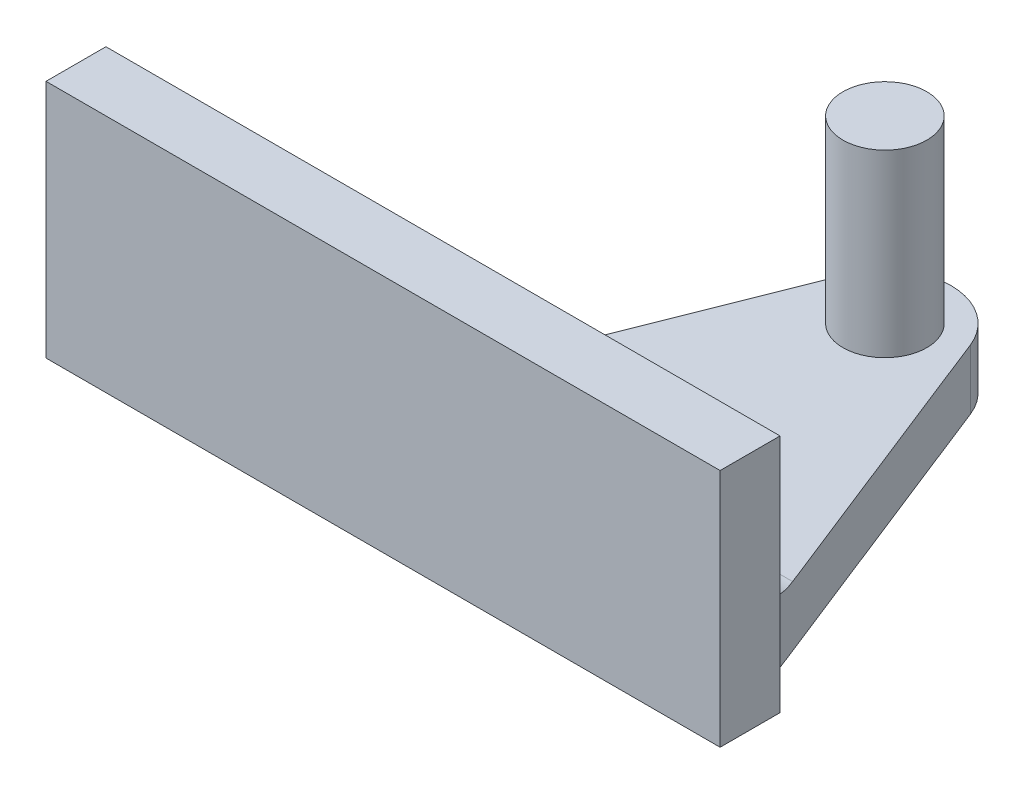
ISO-10303-21;
HEADER;
FILE_DESCRIPTION(('STEP AP214'),'2;1');
FILE_NAME('part.step','',(''),(''),'','','');
FILE_SCHEMA(('AUTOMOTIVE_DESIGN { 1 0 10303 214 1 1 1 1 }'));
ENDSEC;
DATA;
#1=APPLICATION_CONTEXT('core data for automotive mechanical design processes');
#2=APPLICATION_PROTOCOL_DEFINITION('international standard','automotive_design',2000,#1);
#3=PRODUCT_CONTEXT('',#1,'mechanical');
#4=PRODUCT('Part','Part','',(#3));
#5=PRODUCT_RELATED_PRODUCT_CATEGORY('part','',(#4));
#6=PRODUCT_DEFINITION_FORMATION('','',#4);
#7=PRODUCT_DEFINITION_CONTEXT('part definition',#1,'design');
#8=PRODUCT_DEFINITION('design','',#6,#7);
#9=PRODUCT_DEFINITION_SHAPE('','',#8);
#10=(LENGTH_UNIT() NAMED_UNIT(*) SI_UNIT(.MILLI.,.METRE.));
#11=(NAMED_UNIT(*) PLANE_ANGLE_UNIT() SI_UNIT($,.RADIAN.));
#12=(NAMED_UNIT(*) SI_UNIT($,.STERADIAN.) SOLID_ANGLE_UNIT());
#13=UNCERTAINTY_MEASURE_WITH_UNIT(LENGTH_MEASURE(1.E-05),#10,'distance_accuracy_value','');
#14=(GEOMETRIC_REPRESENTATION_CONTEXT(3) GLOBAL_UNCERTAINTY_ASSIGNED_CONTEXT((#13)) GLOBAL_UNIT_ASSIGNED_CONTEXT((#10,
#11,#12)) REPRESENTATION_CONTEXT('',''));
#15=CARTESIAN_POINT('',(0.,0.,0.));
#16=DIRECTION('',(0.,0.,1.));
#17=DIRECTION('',(1.,0.,0.));
#18=AXIS2_PLACEMENT_3D('',#15,#16,#17);
#19=CARTESIAN_POINT('',(0.,10.,0.));
#20=DIRECTION('',(0.,1.,0.));
#21=DIRECTION('',(0.,0.,1.));
#22=AXIS2_PLACEMENT_3D('',#19,#20,#21);
#23=PLANE('',#22);
#24=CARTESIAN_POINT('',(0.,10.,0.));
#25=DIRECTION('',(0.,1.,0.));
#26=DIRECTION('',(0.,0.,1.));
#27=AXIS2_PLACEMENT_3D('',#24,#25,#26);
#28=CIRCLE('',#27,7.);
#29=CARTESIAN_POINT('',(0.,10.,7.));
#30=VERTEX_POINT('',#29);
#31=EDGE_CURVE('E148',#30,#30,#28,.T.);
#32=ORIENTED_EDGE('',*,*,#31,.F.);
#33=EDGE_LOOP('',(#32));
#34=FACE_BOUND('',#33,.T.);
#35=DIRECTION('',(-0.367354438556837,0.,0.930081026831851));
#36=VECTOR('',#35,1.);
#37=CARTESIAN_POINT('',(-10.2308912951504,10.,-4.04089882412521));
#38=LINE('',#37,#36);
#39=CARTESIAN_POINT('',(-10.2308912951504,10.,-4.04089882412521));
#40=VERTEX_POINT('',#39);
#41=CARTESIAN_POINT('',(-29.6005927879604,10.,45.));
#42=VERTEX_POINT('',#41);
#43=EDGE_CURVE('E179',#40,#42,#38,.T.);
#44=ORIENTED_EDGE('',*,*,#43,.T.);
#45=DIRECTION('',(1.,0.,0.));
#46=VECTOR('',#45,1.);
#47=CARTESIAN_POINT('',(33.5502963939802,10.,45.));
#48=LINE('',#47,#46);
#49=CARTESIAN_POINT('',(29.6005927879604,10.,45.));
#50=VERTEX_POINT('',#49);
#51=EDGE_CURVE('E229',#42,#50,#48,.T.);
#52=ORIENTED_EDGE('',*,*,#51,.T.);
#53=DIRECTION('',(-0.367354438556837,0.,-0.930081026831851));
#54=VECTOR('',#53,1.);
#55=CARTESIAN_POINT('',(10.2308912951504,10.,-4.04089882412521));
#56=LINE('',#55,#54);
#57=CARTESIAN_POINT('',(10.2308912951504,10.,-4.04089882412521));
#58=VERTEX_POINT('',#57);
#59=EDGE_CURVE('E172',#50,#58,#56,.T.);
#60=ORIENTED_EDGE('',*,*,#59,.T.);
#61=CARTESIAN_POINT('',(0.,10.,0.));
#62=DIRECTION('',(0.,1.,0.));
#63=DIRECTION('',(0.,0.,1.));
#64=AXIS2_PLACEMENT_3D('',#61,#62,#63);
#65=CIRCLE('',#64,11.);
#66=EDGE_CURVE('E175',#58,#40,#65,.T.);
#67=ORIENTED_EDGE('',*,*,#66,.T.);
#68=EDGE_LOOP('',(#44,#52,#60,#67));
#69=FACE_BOUND('',#68,.T.);
#70=ADVANCED_FACE('F41',(#34,#69),#23,.T.);
#71=CARTESIAN_POINT('',(-75.,10.,0.));
#72=DIRECTION('',(-1.,0.,0.));
#73=DIRECTION('',(0.,0.,1.));
#74=AXIS2_PLACEMENT_3D('',#71,#72,#73);
#75=PLANE('',#74);
#76=DIRECTION('',(0.,0.,-1.));
#77=VECTOR('',#76,1.);
#78=CARTESIAN_POINT('',(-75.,0.,0.));
#79=LINE('',#78,#77);
#80=CARTESIAN_POINT('',(-75.,0.,65.));
#81=VERTEX_POINT('',#80);
#82=CARTESIAN_POINT('',(-75.,0.,55.));
#83=VERTEX_POINT('',#82);
#84=EDGE_CURVE('E187',#81,#83,#79,.T.);
#85=ORIENTED_EDGE('',*,*,#84,.F.);
#86=DIRECTION('',(0.,-1.,0.));
#87=VECTOR('',#86,1.);
#88=CARTESIAN_POINT('',(-75.,10.,65.));
#89=LINE('',#88,#87);
#90=CARTESIAN_POINT('',(-75.,40.,65.));
#91=VERTEX_POINT('',#90);
#92=EDGE_CURVE('E136',#91,#81,#89,.T.);
#93=ORIENTED_EDGE('',*,*,#92,.F.);
#94=DIRECTION('',(0.,0.,1.));
#95=VECTOR('',#94,1.);
#96=CARTESIAN_POINT('',(-75.,40.,0.));
#97=LINE('',#96,#95);
#98=CARTESIAN_POINT('',(-75.,40.,55.));
#99=VERTEX_POINT('',#98);
#100=EDGE_CURVE('E146',#99,#91,#97,.T.);
#101=ORIENTED_EDGE('',*,*,#100,.F.);
#102=DIRECTION('',(0.,-1.,0.));
#103=VECTOR('',#102,1.);
#104=CARTESIAN_POINT('',(-75.,10.,55.));
#105=LINE('',#104,#103);
#106=EDGE_CURVE('E216',#99,#83,#105,.T.);
#107=ORIENTED_EDGE('',*,*,#106,.T.);
#108=EDGE_LOOP('',(#85,#93,#101,#107));
#109=FACE_BOUND('',#108,.T.);
#110=ADVANCED_FACE('F256',(#109),#75,.T.);
#111=CARTESIAN_POINT('',(0.,10.,65.));
#112=DIRECTION('',(0.,0.,-1.));
#113=DIRECTION('',(-1.,0.,0.));
#114=AXIS2_PLACEMENT_3D('',#111,#112,#113);
#115=PLANE('',#114);
#116=DIRECTION('',(1.,0.,0.));
#117=VECTOR('',#116,1.);
#118=CARTESIAN_POINT('',(0.,0.,65.));
#119=LINE('',#118,#117);
#120=CARTESIAN_POINT('',(37.5,0.,65.));
#121=VERTEX_POINT('',#120);
#122=EDGE_CURVE('E130',#81,#121,#119,.T.);
#123=ORIENTED_EDGE('',*,*,#122,.T.);
#124=DIRECTION('',(0.,-1.,0.));
#125=VECTOR('',#124,1.);
#126=CARTESIAN_POINT('',(37.5,10.,65.));
#127=LINE('',#126,#125);
#128=CARTESIAN_POINT('',(37.5,40.,65.));
#129=VERTEX_POINT('',#128);
#130=EDGE_CURVE('E125',#129,#121,#127,.T.);
#131=ORIENTED_EDGE('',*,*,#130,.F.);
#132=DIRECTION('',(-1.,0.,0.));
#133=VECTOR('',#132,1.);
#134=CARTESIAN_POINT('',(0.,40.,65.));
#135=LINE('',#134,#133);
#136=EDGE_CURVE('E128',#129,#91,#135,.T.);
#137=ORIENTED_EDGE('',*,*,#136,.T.);
#138=ORIENTED_EDGE('',*,*,#92,.T.);
#139=EDGE_LOOP('',(#123,#131,#137,#138));
#140=FACE_BOUND('',#139,.T.);
#141=ADVANCED_FACE('F127',(#140),#115,.F.);
#142=CARTESIAN_POINT('',(37.5,10.,0.));
#143=DIRECTION('',(-1.,0.,0.));
#144=DIRECTION('',(0.,0.,1.));
#145=AXIS2_PLACEMENT_3D('',#142,#143,#144);
#146=PLANE('',#145);
#147=DIRECTION('',(0.,0.,-1.));
#148=VECTOR('',#147,1.);
#149=CARTESIAN_POINT('',(37.5,0.,0.));
#150=LINE('',#149,#148);
#151=CARTESIAN_POINT('',(37.5,0.,55.));
#152=VERTEX_POINT('',#151);
#153=EDGE_CURVE('E193',#121,#152,#150,.T.);
#154=ORIENTED_EDGE('',*,*,#153,.T.);
#155=DIRECTION('',(0.,-1.,0.));
#156=VECTOR('',#155,1.);
#157=CARTESIAN_POINT('',(37.5,10.,55.));
#158=LINE('',#157,#156);
#159=CARTESIAN_POINT('',(37.5,20.,55.));
#160=VERTEX_POINT('',#159);
#161=EDGE_CURVE('E211',#160,#152,#158,.T.);
#162=ORIENTED_EDGE('',*,*,#161,.F.);
#163=CARTESIAN_POINT('',(37.5,40.,55.));
#164=VERTEX_POINT('',#163);
#165=EDGE_CURVE('E137',#164,#160,#158,.T.);
#166=ORIENTED_EDGE('',*,*,#165,.F.);
#167=DIRECTION('',(0.,0.,1.));
#168=VECTOR('',#167,1.);
#169=CARTESIAN_POINT('',(37.5,40.,0.));
#170=LINE('',#169,#168);
#171=EDGE_CURVE('E144',#164,#129,#170,.T.);
#172=ORIENTED_EDGE('',*,*,#171,.T.);
#173=ORIENTED_EDGE('',*,*,#130,.T.);
#174=EDGE_LOOP('',(#154,#162,#166,#172,#173));
#175=FACE_BOUND('',#174,.T.);
#176=ADVANCED_FACE('F150',(#175),#146,.F.);
#177=CARTESIAN_POINT('',(0.,10.,55.));
#178=DIRECTION('',(0.,0.,-1.));
#179=DIRECTION('',(-1.,0.,0.));
#180=AXIS2_PLACEMENT_3D('',#177,#178,#179);
#181=PLANE('',#180);
#182=DIRECTION('',(1.,0.,0.));
#183=VECTOR('',#182,1.);
#184=CARTESIAN_POINT('',(-33.5502963939802,20.,55.));
#185=LINE('',#184,#183);
#186=CARTESIAN_POINT('',(-40.3523442069342,20.,55.));
#187=VERTEX_POINT('',#186);
#188=EDGE_CURVE('E221',#160,#187,#185,.F.);
#189=ORIENTED_EDGE('',*,*,#188,.T.);
#190=DIRECTION('',(0.,-1.,0.));
#191=VECTOR('',#190,1.);
#192=CARTESIAN_POINT('',(-40.3523442069342,10.,55.));
#193=LINE('',#192,#191);
#194=CARTESIAN_POINT('',(-40.3523442069342,0.,55.));
#195=VERTEX_POINT('',#194);
#196=EDGE_CURVE('E224',#187,#195,#193,.T.);
#197=ORIENTED_EDGE('',*,*,#196,.T.);
#198=DIRECTION('',(1.,0.,0.));
#199=VECTOR('',#198,1.);
#200=CARTESIAN_POINT('',(0.,0.,55.));
#201=LINE('',#200,#199);
#202=EDGE_CURVE('E168',#83,#195,#201,.T.);
#203=ORIENTED_EDGE('',*,*,#202,.F.);
#204=ORIENTED_EDGE('',*,*,#106,.F.);
#205=DIRECTION('',(-1.,0.,0.));
#206=VECTOR('',#205,1.);
#207=CARTESIAN_POINT('',(0.,40.,55.));
#208=LINE('',#207,#206);
#209=EDGE_CURVE('E154',#164,#99,#208,.T.);
#210=ORIENTED_EDGE('',*,*,#209,.F.);
#211=ORIENTED_EDGE('',*,*,#165,.T.);
#212=EDGE_LOOP('',(#189,#197,#203,#204,#210,#211));
#213=FACE_BOUND('',#212,.T.);
#214=ADVANCED_FACE('F283',(#213),#181,.T.);
#215=CARTESIAN_POINT('',(10.2308912951504,10.,-4.04089882412521));
#216=DIRECTION('',(-0.930081026831851,0.,0.367354438556837));
#217=DIRECTION('',(0.367354438556837,0.,0.930081026831851));
#218=AXIS2_PLACEMENT_3D('',#215,#216,#217);
#219=PLANE('',#218);
#220=ORIENTED_EDGE('',*,*,#59,.F.);
#221=CARTESIAN_POINT('',(29.6005927879604,20.,45.));
#222=DIRECTION('',(-0.930081026831851,0.,0.367354438556837));
#223=DIRECTION('',(-0.367354438556837,0.,-0.930081026831851));
#224=AXIS2_PLACEMENT_3D('',#221,#222,#223);
#225=ELLIPSE('',#224,10.7517514189738,10.);
#226=CARTESIAN_POINT('',(31.2383609442636,10.9002174118723,49.1465596400882));
#227=VERTEX_POINT('',#226);
#228=EDGE_CURVE('E51',#50,#227,#225,.T.);
#229=ORIENTED_EDGE('',*,*,#228,.T.);
#230=DIRECTION('',(0.,1.,0.));
#231=VECTOR('',#230,1.);
#232=CARTESIAN_POINT('',(31.2383609442636,10.,49.1465596400882));
#233=LINE('',#232,#231);
#234=CARTESIAN_POINT('',(31.2383609442636,0.,49.1465596400882));
#235=VERTEX_POINT('',#234);
#236=EDGE_CURVE('E66',#227,#235,#233,.F.);
#237=ORIENTED_EDGE('',*,*,#236,.T.);
#238=DIRECTION('',(-0.367354438556837,0.,-0.930081026831851));
#239=VECTOR('',#238,1.);
#240=CARTESIAN_POINT('',(10.2308912951504,0.,-4.04089882412521));
#241=LINE('',#240,#239);
#242=CARTESIAN_POINT('',(10.2308912951504,0.,-4.04089882412521));
#243=VERTEX_POINT('',#242);
#244=EDGE_CURVE('E196',#235,#243,#241,.T.);
#245=ORIENTED_EDGE('',*,*,#244,.T.);
#246=DIRECTION('',(0.,-1.,0.));
#247=VECTOR('',#246,1.);
#248=CARTESIAN_POINT('',(10.2308912951504,10.,-4.04089882412521));
#249=LINE('',#248,#247);
#250=EDGE_CURVE('E207',#58,#243,#249,.T.);
#251=ORIENTED_EDGE('',*,*,#250,.F.);
#252=EDGE_LOOP('',(#220,#229,#237,#245,#251));
#253=FACE_BOUND('',#252,.T.);
#254=ADVANCED_FACE('F279',(#253),#219,.F.);
#255=CARTESIAN_POINT('',(0.,10.,0.));
#256=DIRECTION('',(0.,-1.,0.));
#257=DIRECTION('',(0.,0.,-1.));
#258=AXIS2_PLACEMENT_3D('',#255,#256,#257);
#259=CYLINDRICAL_SURFACE('',#258,11.);
#260=CARTESIAN_POINT('',(0.,0.,0.));
#261=DIRECTION('',(0.,1.,0.));
#262=DIRECTION('',(0.,0.,1.));
#263=AXIS2_PLACEMENT_3D('',#260,#261,#262);
#264=CIRCLE('',#263,11.);
#265=CARTESIAN_POINT('',(-10.2308912951504,0.,-4.04089882412521));
#266=VERTEX_POINT('',#265);
#267=EDGE_CURVE('E199',#243,#266,#264,.T.);
#268=ORIENTED_EDGE('',*,*,#267,.T.);
#269=DIRECTION('',(0.,-1.,0.));
#270=VECTOR('',#269,1.);
#271=CARTESIAN_POINT('',(-10.2308912951504,10.,-4.04089882412521));
#272=LINE('',#271,#270);
#273=EDGE_CURVE('E183',#40,#266,#272,.T.);
#274=ORIENTED_EDGE('',*,*,#273,.F.);
#275=ORIENTED_EDGE('',*,*,#66,.F.);
#276=ORIENTED_EDGE('',*,*,#250,.T.);
#277=EDGE_LOOP('',(#268,#274,#275,#276));
#278=FACE_BOUND('',#277,.T.);
#279=ADVANCED_FACE('F276',(#278),#259,.T.);
#280=CARTESIAN_POINT('',(-10.2308912951504,10.,-4.04089882412521));
#281=DIRECTION('',(0.930081026831851,0.,0.367354438556837));
#282=DIRECTION('',(0.367354438556837,0.,-0.930081026831851));
#283=AXIS2_PLACEMENT_3D('',#280,#281,#282);
#284=PLANE('',#283);
#285=DIRECTION('',(-0.367354438556837,0.,0.930081026831851));
#286=VECTOR('',#285,1.);
#287=CARTESIAN_POINT('',(-10.2308912951504,0.,-4.04089882412521));
#288=LINE('',#287,#286);
#289=CARTESIAN_POINT('',(-31.0515339386157,0.,48.6735443855684));
#290=VERTEX_POINT('',#289);
#291=EDGE_CURVE('E176',#266,#290,#288,.T.);
#292=ORIENTED_EDGE('',*,*,#291,.T.);
#293=DIRECTION('',(0.,-1.,0.));
#294=VECTOR('',#293,1.);
#295=CARTESIAN_POINT('',(-31.0515339386157,10.,48.6735443855684));
#296=LINE('',#295,#294);
#297=CARTESIAN_POINT('',(-31.0515339386157,10.6991897316815,48.6735443855684));
#298=VERTEX_POINT('',#297);
#299=EDGE_CURVE('E58',#290,#298,#296,.F.);
#300=ORIENTED_EDGE('',*,*,#299,.T.);
#301=CARTESIAN_POINT('',(-29.6005927879604,20.,45.));
#302=DIRECTION('',(0.930081026831851,0.,0.367354438556837));
#303=DIRECTION('',(-0.367354438556837,0.,0.930081026831851));
#304=AXIS2_PLACEMENT_3D('',#301,#302,#303);
#305=ELLIPSE('',#304,10.7517514189738,10.);
#306=EDGE_CURVE('E11',#298,#42,#305,.T.);
#307=ORIENTED_EDGE('',*,*,#306,.T.);
#308=ORIENTED_EDGE('',*,*,#43,.F.);
#309=ORIENTED_EDGE('',*,*,#273,.T.);
#310=EDGE_LOOP('',(#292,#300,#307,#308,#309));
#311=FACE_BOUND('',#310,.T.);
#312=ADVANCED_FACE('F272',(#311),#284,.F.);
#313=CARTESIAN_POINT('',(0.,0.,0.));
#314=DIRECTION('',(0.,1.,0.));
#315=DIRECTION('',(0.,0.,1.));
#316=AXIS2_PLACEMENT_3D('',#313,#314,#315);
#317=PLANE('',#316);
#318=ORIENTED_EDGE('',*,*,#202,.T.);
#319=CARTESIAN_POINT('',(-40.3523442069342,0.,45.));
#320=DIRECTION('',(0.,1.,0.));
#321=DIRECTION('',(0.,0.,1.));
#322=AXIS2_PLACEMENT_3D('',#319,#320,#321);
#323=CIRCLE('',#322,10.);
#324=EDGE_CURVE('E235',#195,#290,#323,.T.);
#325=ORIENTED_EDGE('',*,*,#324,.T.);
#326=ORIENTED_EDGE('',*,*,#291,.F.);
#327=ORIENTED_EDGE('',*,*,#267,.F.);
#328=ORIENTED_EDGE('',*,*,#244,.F.);
#329=CARTESIAN_POINT('',(40.5391712125822,0.,45.4730152545198));
#330=DIRECTION('',(0.,1.,0.));
#331=DIRECTION('',(0.,0.,1.));
#332=AXIS2_PLACEMENT_3D('',#329,#330,#331);
#333=CIRCLE('',#332,10.);
#334=EDGE_CURVE('E232',#235,#152,#333,.T.);
#335=ORIENTED_EDGE('',*,*,#334,.T.);
#336=ORIENTED_EDGE('',*,*,#153,.F.);
#337=ORIENTED_EDGE('',*,*,#122,.F.);
#338=ORIENTED_EDGE('',*,*,#84,.T.);
#339=EDGE_LOOP('',(#318,#325,#326,#327,#328,#335,#336,#337,#338));
#340=FACE_BOUND('',#339,.T.);
#341=ADVANCED_FACE('F269',(#340),#317,.F.);
#342=CARTESIAN_POINT('',(0.,40.,0.));
#343=DIRECTION('',(0.,-1.,0.));
#344=DIRECTION('',(0.,0.,-1.));
#345=AXIS2_PLACEMENT_3D('',#342,#343,#344);
#346=CYLINDRICAL_SURFACE('',#345,7.);
#347=CARTESIAN_POINT('',(0.,40.,0.));
#348=DIRECTION('',(0.,1.,0.));
#349=DIRECTION('',(0.,0.,1.));
#350=AXIS2_PLACEMENT_3D('',#347,#348,#349);
#351=CIRCLE('',#350,7.);
#352=CARTESIAN_POINT('',(0.,40.,7.));
#353=VERTEX_POINT('',#352);
#354=EDGE_CURVE('E164',#353,#353,#351,.T.);
#355=ORIENTED_EDGE('',*,*,#354,.F.);
#356=EDGE_LOOP('',(#355));
#357=FACE_BOUND('',#356,.T.);
#358=ORIENTED_EDGE('',*,*,#31,.T.);
#359=EDGE_LOOP('',(#358));
#360=FACE_BOUND('',#359,.T.);
#361=ADVANCED_FACE('F267',(#357,#360),#346,.T.);
#362=CARTESIAN_POINT('',(0.,40.,0.));
#363=DIRECTION('',(0.,1.,0.));
#364=DIRECTION('',(0.,0.,1.));
#365=AXIS2_PLACEMENT_3D('',#362,#363,#364);
#366=PLANE('',#365);
#367=ORIENTED_EDGE('',*,*,#354,.T.);
#368=EDGE_LOOP('',(#367));
#369=FACE_BOUND('',#368,.T.);
#370=ADVANCED_FACE('F326',(#369),#366,.T.);
#371=CARTESIAN_POINT('',(0.,40.,0.));
#372=DIRECTION('',(0.,1.,0.));
#373=DIRECTION('',(0.,0.,1.));
#374=AXIS2_PLACEMENT_3D('',#371,#372,#373);
#375=PLANE('',#374);
#376=ORIENTED_EDGE('',*,*,#136,.F.);
#377=ORIENTED_EDGE('',*,*,#171,.F.);
#378=ORIENTED_EDGE('',*,*,#209,.T.);
#379=ORIENTED_EDGE('',*,*,#100,.T.);
#380=EDGE_LOOP('',(#376,#377,#378,#379));
#381=FACE_BOUND('',#380,.T.);
#382=ADVANCED_FACE('F142',(#381),#375,.T.);
#383=CARTESIAN_POINT('',(-40.3523442069342,10.,45.));
#384=DIRECTION('',(0.,-1.,0.));
#385=DIRECTION('',(0.,0.,-1.));
#386=AXIS2_PLACEMENT_3D('',#383,#384,#385);
#387=CYLINDRICAL_SURFACE('',#386,10.);
#388=ORIENTED_EDGE('',*,*,#324,.F.);
#389=ORIENTED_EDGE('',*,*,#196,.F.);
#390=CARTESIAN_POINT('',(-40.3523442069342,20.,45.));
#391=DIRECTION('',(-0.707106781186547,-0.707106781186547,0.));
#392=DIRECTION('',(-0.707106781186547,0.707106781186547,0.));
#393=AXIS2_PLACEMENT_3D('',#390,#391,#392);
#394=ELLIPSE('',#393,14.1421356237309,10.);
#395=EDGE_CURVE('E45',#298,#187,#394,.T.);
#396=ORIENTED_EDGE('',*,*,#395,.F.);
#397=ORIENTED_EDGE('',*,*,#299,.F.);
#398=EDGE_LOOP('',(#388,#389,#396,#397));
#399=FACE_BOUND('',#398,.T.);
#400=ADVANCED_FACE('F43',(#399),#387,.F.);
#401=CARTESIAN_POINT('',(0.,20.,45.));
#402=DIRECTION('',(-1.,0.,0.));
#403=DIRECTION('',(0.,0.,1.));
#404=AXIS2_PLACEMENT_3D('',#401,#402,#403);
#405=CYLINDRICAL_SURFACE('',#404,10.);
#406=ORIENTED_EDGE('',*,*,#395,.T.);
#407=ORIENTED_EDGE('',*,*,#188,.F.);
#408=CARTESIAN_POINT('',(37.5,20.,55.));
#409=CARTESIAN_POINT('',(37.5001052605313,19.896950716965,55.0000179156801));
#410=CARTESIAN_POINT('',(37.4950088730996,19.7939736075136,54.998407959659));
#411=CARTESIAN_POINT('',(37.4752574992648,19.5893072603563,54.9920812320027));
#412=CARTESIAN_POINT('',(37.4606285149809,19.4876152841616,54.98737291145));
#413=CARTESIAN_POINT('',(37.4230093421556,19.2880093140537,54.9751145893136));
#414=CARTESIAN_POINT('',(37.4001834160788,19.1900602504458,54.9676203195211));
#415=CARTESIAN_POINT('',(37.3473193752197,18.9963277116638,54.9499802231196));
#416=CARTESIAN_POINT('',(37.3172759141289,18.9005458996762,54.939832430448));
#417=CARTESIAN_POINT('',(37.2299079776709,18.6504409541384,54.9097547498307));
#418=CARTESIAN_POINT('',(37.1674773212481,18.4981566318994,54.8877346216604));
#419=CARTESIAN_POINT('',(37.0311716603983,18.1998381686354,54.8378011559365));
#420=CARTESIAN_POINT('',(36.9572881386453,18.0538087833181,54.8098834267728));
#421=CARTESIAN_POINT('',(36.8006540231821,17.7655232915989,54.7482866985296));
#422=CARTESIAN_POINT('',(36.7178067760939,17.6233344070409,54.7145419468408));
#423=CARTESIAN_POINT('',(36.5465592078103,17.3438027698584,54.6418598833681));
#424=CARTESIAN_POINT('',(36.4581601914487,17.206458890274,54.6029237893091));
#425=CARTESIAN_POINT('',(36.2629325781806,16.9139349638186,54.5133195505473));
#426=CARTESIAN_POINT('',(36.155438426935,16.7594701558547,54.4617726606191));
#427=CARTESIAN_POINT('',(35.9372334946452,16.4552249906947,54.3520424243512));
#428=CARTESIAN_POINT('',(35.8265220099994,16.305445673272,54.293857618095));
#429=CARTESIAN_POINT('',(35.4915077609463,15.8620292030528,54.1093322549459));
#430=CARTESIAN_POINT('',(35.2644662745485,15.5745172140163,53.9730838453158));
#431=CARTESIAN_POINT('',(34.8110482275736,15.0144719305352,53.6743770529385));
#432=CARTESIAN_POINT('',(34.5846714973751,14.7419010108336,53.5119889848913));
#433=CARTESIAN_POINT('',(34.136819164094,14.2108282055426,53.1600777239253));
#434=CARTESIAN_POINT('',(33.9153406465789,13.9523178125939,52.9705711969328));
#435=CARTESIAN_POINT('',(33.525940175209,13.5019855424448,52.6053696625318));
#436=CARTESIAN_POINT('',(33.3563714834248,13.3073825139025,52.4348496240432));
#437=CARTESIAN_POINT('',(33.0248125051024,12.9286507974742,52.0756025052201));
#438=CARTESIAN_POINT('',(32.8628233500375,12.7445236725509,51.8868727193292));
#439=CARTESIAN_POINT('',(32.5491206436763,12.3887936720923,51.4915333015698));
#440=CARTESIAN_POINT('',(32.3973746660572,12.2171511266232,51.2849853124732));
#441=CARTESIAN_POINT('',(32.1059140887112,11.8875377872487,50.8533459357433));
#442=CARTESIAN_POINT('',(31.9661959879003,11.7295630148494,50.6282599817377));
#443=CARTESIAN_POINT('',(31.7234035932604,11.4544286052015,50.1987443121421));
#444=CARTESIAN_POINT('',(31.6181031051481,11.3348546914295,49.9971245434764));
#445=CARTESIAN_POINT('',(31.4190777317188,11.1079327756954,49.5811993390791));
#446=CARTESIAN_POINT('',(31.3253714094843,11.0006044005644,49.3668743524328));
#447=CARTESIAN_POINT('',(31.2383609442636,10.9002174118723,49.1465596400882));
#448=B_SPLINE_CURVE_WITH_KNOTS('',3,(#408,#409,#410,#411,#412,#413,#414,#415,#416,#417,#418,
#419,#420,#421,#422,#423,#424,#425,#426,#427,#428,#429,#430,#431,#432,#433,#434,#435,#436,#437,
#438,#439,#440,#441,#442,#443,#444,#445,#446,#447),.UNSPECIFIED.,.F.,.F.,(4,2,2,2,2,2,2,2,2,2,2,
2,2,2,2,2,2,2,2,4),(0.,0.308894075727667,0.61694908655354,0.91914695779432,1.22156937271831,
1.71882297371884,2.21644816487059,2.72010721356062,3.22364832692831,3.80876773169685,
4.39401607426577,5.56527739743091,6.73343916333112,7.90088608226063,8.82823457136272,
9.75572105626325,10.680118522676,11.6042459984506,12.3743477121812,13.145666882319),.UNSPECIFIED.);
#449=EDGE_CURVE('E160',#227,#160,#448,.F.);
#450=ORIENTED_EDGE('',*,*,#449,.F.);
#451=ORIENTED_EDGE('',*,*,#228,.F.);
#452=ORIENTED_EDGE('',*,*,#51,.F.);
#453=ORIENTED_EDGE('',*,*,#306,.F.);
#454=EDGE_LOOP('',(#406,#407,#450,#451,#452,#453));
#455=FACE_BOUND('',#454,.T.);
#456=ADVANCED_FACE('F245',(#455),#405,.F.);
#457=CARTESIAN_POINT('',(40.5391712125822,10.,45.4730152545198));
#458=DIRECTION('',(0.,1.,0.));
#459=DIRECTION('',(0.,0.,1.));
#460=AXIS2_PLACEMENT_3D('',#457,#458,#459);
#461=CYLINDRICAL_SURFACE('',#460,10.);
#462=ORIENTED_EDGE('',*,*,#449,.T.);
#463=ORIENTED_EDGE('',*,*,#161,.T.);
#464=ORIENTED_EDGE('',*,*,#334,.F.);
#465=ORIENTED_EDGE('',*,*,#236,.F.);
#466=EDGE_LOOP('',(#462,#463,#464,#465));
#467=FACE_BOUND('',#466,.T.);
#468=ADVANCED_FACE('F248',(#467),#461,.F.);
#469=CLOSED_SHELL('',(#70,#110,#141,#176,#214,#254,#279,#312,#341,#361,#370,#382,#400,#456,#468));
#470=MANIFOLD_SOLID_BREP('B2',#469);
#471=ADVANCED_BREP_SHAPE_REPRESENTATION('',(#18,#470),#14);
#472=SHAPE_DEFINITION_REPRESENTATION(#9,#471);
ENDSEC;
END-ISO-10303-21;
